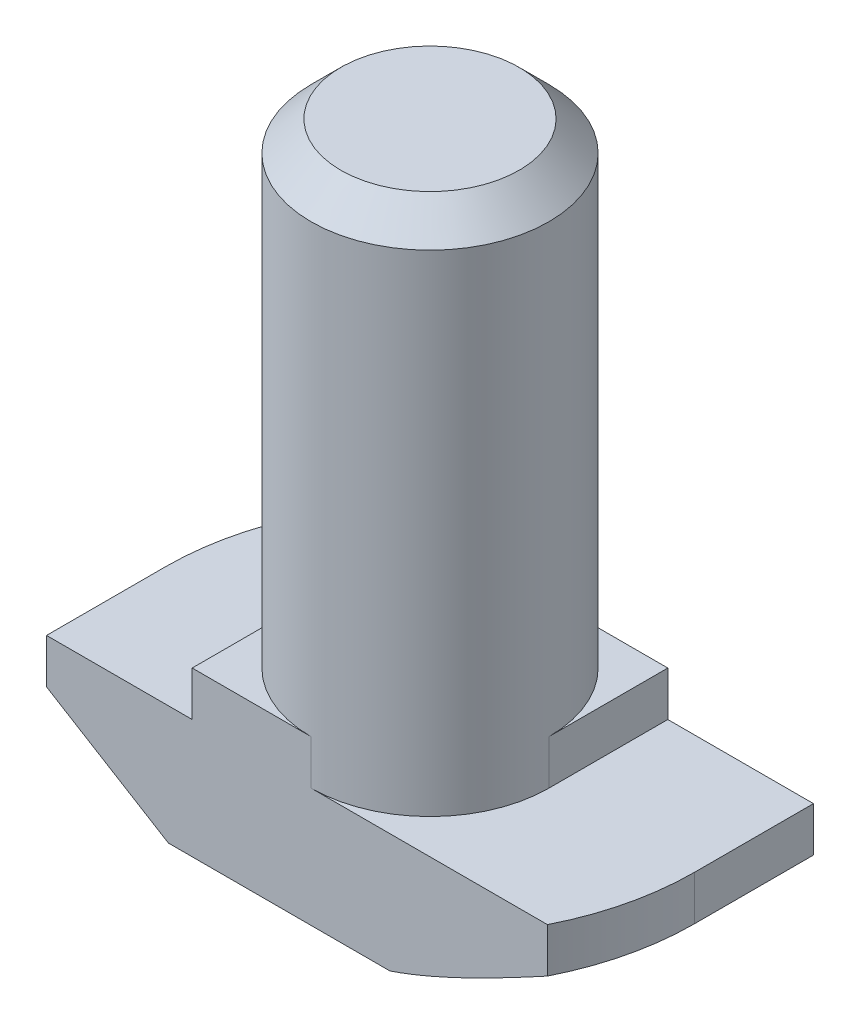
ISO-10303-21;
HEADER;
FILE_DESCRIPTION(('STEP AP214'),'2;1');
FILE_NAME('part.step','',(''),(''),'','','');
FILE_SCHEMA(('AUTOMOTIVE_DESIGN { 1 0 10303 214 1 1 1 1 }'));
ENDSEC;
DATA;
#1=APPLICATION_CONTEXT('core data for automotive mechanical design processes');
#2=APPLICATION_PROTOCOL_DEFINITION('international standard','automotive_design',2000,#1);
#3=PRODUCT_CONTEXT('',#1,'mechanical');
#4=PRODUCT('Part','Part','',(#3));
#5=PRODUCT_RELATED_PRODUCT_CATEGORY('part','',(#4));
#6=PRODUCT_DEFINITION_FORMATION('','',#4);
#7=PRODUCT_DEFINITION_CONTEXT('part definition',#1,'design');
#8=PRODUCT_DEFINITION('design','',#6,#7);
#9=PRODUCT_DEFINITION_SHAPE('','',#8);
#10=(LENGTH_UNIT() NAMED_UNIT(*) SI_UNIT(.MILLI.,.METRE.));
#11=(NAMED_UNIT(*) PLANE_ANGLE_UNIT() SI_UNIT($,.RADIAN.));
#12=(NAMED_UNIT(*) SI_UNIT($,.STERADIAN.) SOLID_ANGLE_UNIT());
#13=UNCERTAINTY_MEASURE_WITH_UNIT(LENGTH_MEASURE(1.E-05),#10,'distance_accuracy_value','');
#14=(GEOMETRIC_REPRESENTATION_CONTEXT(3) GLOBAL_UNCERTAINTY_ASSIGNED_CONTEXT((#13)) GLOBAL_UNIT_ASSIGNED_CONTEXT((#10,
#11,#12)) REPRESENTATION_CONTEXT('',''));
#15=CARTESIAN_POINT('',(0.,0.,0.));
#16=DIRECTION('',(0.,0.,1.));
#17=DIRECTION('',(1.,0.,0.));
#18=AXIS2_PLACEMENT_3D('',#15,#16,#17);
#19=CARTESIAN_POINT('',(-8.9,0.,4.));
#20=DIRECTION('',(1.,0.,0.));
#21=DIRECTION('',(0.,0.,-1.));
#22=AXIS2_PLACEMENT_3D('',#19,#20,#21);
#23=PLANE('',#22);
#24=DIRECTION('',(0.,0.,-1.));
#25=VECTOR('',#24,1.);
#26=CARTESIAN_POINT('',(-8.9,2.5,4.));
#27=LINE('',#26,#25);
#28=CARTESIAN_POINT('',(-8.9,2.5,4.));
#29=VERTEX_POINT('',#28);
#30=CARTESIAN_POINT('',(-8.9,2.5,0.));
#31=VERTEX_POINT('',#30);
#32=EDGE_CURVE('E368',#29,#31,#27,.T.);
#33=ORIENTED_EDGE('',*,*,#32,.F.);
#34=DIRECTION('',(0.,-1.,0.));
#35=VECTOR('',#34,1.);
#36=CARTESIAN_POINT('',(-8.9,0.,4.));
#37=LINE('',#36,#35);
#38=CARTESIAN_POINT('',(-8.9,4.,4.));
#39=VERTEX_POINT('',#38);
#40=EDGE_CURVE('E208',#39,#29,#37,.T.);
#41=ORIENTED_EDGE('',*,*,#40,.F.);
#42=DIRECTION('',(0.,0.,-1.));
#43=VECTOR('',#42,1.);
#44=CARTESIAN_POINT('',(-8.9,4.,4.));
#45=LINE('',#44,#43);
#46=CARTESIAN_POINT('',(-8.9,4.,0.));
#47=VERTEX_POINT('',#46);
#48=EDGE_CURVE('E223',#39,#47,#45,.T.);
#49=ORIENTED_EDGE('',*,*,#48,.T.);
#50=DIRECTION('',(0.,1.,0.));
#51=VECTOR('',#50,1.);
#52=CARTESIAN_POINT('',(-8.9,0.,0.));
#53=LINE('',#52,#51);
#54=EDGE_CURVE('E196',#31,#47,#53,.T.);
#55=ORIENTED_EDGE('',*,*,#54,.F.);
#56=EDGE_LOOP('',(#33,#41,#49,#55));
#57=FACE_BOUND('',#56,.T.);
#58=ADVANCED_FACE('F38',(#57),#23,.F.);
#59=CARTESIAN_POINT('',(8.9,0.,4.));
#60=DIRECTION('',(0.,1.,0.));
#61=DIRECTION('',(0.,0.,1.));
#62=AXIS2_PLACEMENT_3D('',#59,#60,#61);
#63=PLANE('',#62);
#64=DIRECTION('',(1.,0.,0.));
#65=VECTOR('',#64,1.);
#66=CARTESIAN_POINT('',(8.9,0.,4.));
#67=LINE('',#66,#65);
#68=CARTESIAN_POINT('',(-4.8,0.,4.));
#69=VERTEX_POINT('',#68);
#70=CARTESIAN_POINT('',(2.65329983228432,0.,4.));
#71=VERTEX_POINT('',#70);
#72=EDGE_CURVE('E211',#69,#71,#67,.T.);
#73=ORIENTED_EDGE('',*,*,#72,.F.);
#74=DIRECTION('',(0.,0.,-1.));
#75=VECTOR('',#74,1.);
#76=CARTESIAN_POINT('',(-4.8,0.,4.));
#77=LINE('',#76,#75);
#78=CARTESIAN_POINT('',(-4.8,0.,0.));
#79=VERTEX_POINT('',#78);
#80=EDGE_CURVE('E366',#69,#79,#77,.T.);
#81=ORIENTED_EDGE('',*,*,#80,.T.);
#82=CARTESIAN_POINT('',(0.,0.,0.));
#83=DIRECTION('',(0.,-1.,0.));
#84=DIRECTION('',(-1.,0.,0.));
#85=AXIS2_PLACEMENT_3D('',#82,#83,#84);
#86=CIRCLE('',#85,4.8);
#87=CARTESIAN_POINT('',(-2.65329983228432,0.,-4.));
#88=VERTEX_POINT('',#87);
#89=EDGE_CURVE('E365',#79,#88,#86,.T.);
#90=ORIENTED_EDGE('',*,*,#89,.T.);
#91=DIRECTION('',(1.,0.,0.));
#92=VECTOR('',#91,1.);
#93=CARTESIAN_POINT('',(8.9,0.,-4.));
#94=LINE('',#93,#92);
#95=CARTESIAN_POINT('',(4.8,0.,-4.));
#96=VERTEX_POINT('',#95);
#97=EDGE_CURVE('E207',#88,#96,#94,.T.);
#98=ORIENTED_EDGE('',*,*,#97,.T.);
#99=DIRECTION('',(0.,0.,1.));
#100=VECTOR('',#99,1.);
#101=CARTESIAN_POINT('',(4.8,0.,-8.9));
#102=LINE('',#101,#100);
#103=CARTESIAN_POINT('',(4.8,0.,0.));
#104=VERTEX_POINT('',#103);
#105=EDGE_CURVE('E54',#96,#104,#102,.T.);
#106=ORIENTED_EDGE('',*,*,#105,.T.);
#107=CARTESIAN_POINT('',(0.,0.,0.));
#108=DIRECTION('',(0.,-1.,0.));
#109=DIRECTION('',(1.,0.,0.));
#110=AXIS2_PLACEMENT_3D('',#107,#108,#109);
#111=CIRCLE('',#110,4.8);
#112=EDGE_CURVE('E154',#104,#71,#111,.T.);
#113=ORIENTED_EDGE('',*,*,#112,.T.);
#114=EDGE_LOOP('',(#73,#81,#90,#98,#106,#113));
#115=FACE_BOUND('',#114,.T.);
#116=ADVANCED_FACE('F269',(#115),#63,.F.);
#117=CARTESIAN_POINT('',(8.9,0.,4.));
#118=DIRECTION('',(-1.,0.,0.));
#119=DIRECTION('',(0.,0.,1.));
#120=AXIS2_PLACEMENT_3D('',#117,#118,#119);
#121=PLANE('',#120);
#122=DIRECTION('',(0.,0.,1.));
#123=VECTOR('',#122,1.);
#124=CARTESIAN_POINT('',(8.9,2.5,-8.9));
#125=LINE('',#124,#123);
#126=CARTESIAN_POINT('',(8.9,2.5,-4.));
#127=VERTEX_POINT('',#126);
#128=CARTESIAN_POINT('',(8.9,2.5,0.));
#129=VERTEX_POINT('',#128);
#130=EDGE_CURVE('E146',#127,#129,#125,.T.);
#131=ORIENTED_EDGE('',*,*,#130,.F.);
#132=DIRECTION('',(0.,1.,0.));
#133=VECTOR('',#132,1.);
#134=CARTESIAN_POINT('',(8.9,0.,-4.));
#135=LINE('',#134,#133);
#136=CARTESIAN_POINT('',(8.9,4.,-4.));
#137=VERTEX_POINT('',#136);
#138=EDGE_CURVE('E226',#127,#137,#135,.T.);
#139=ORIENTED_EDGE('',*,*,#138,.T.);
#140=DIRECTION('',(0.,0.,-1.));
#141=VECTOR('',#140,1.);
#142=CARTESIAN_POINT('',(8.9,4.,4.));
#143=LINE('',#142,#141);
#144=CARTESIAN_POINT('',(8.9,4.,0.));
#145=VERTEX_POINT('',#144);
#146=EDGE_CURVE('E174',#145,#137,#143,.T.);
#147=ORIENTED_EDGE('',*,*,#146,.F.);
#148=DIRECTION('',(0.,1.,0.));
#149=VECTOR('',#148,1.);
#150=CARTESIAN_POINT('',(8.9,0.,0.));
#151=LINE('',#150,#149);
#152=EDGE_CURVE('E167',#129,#145,#151,.T.);
#153=ORIENTED_EDGE('',*,*,#152,.F.);
#154=EDGE_LOOP('',(#131,#139,#147,#153));
#155=FACE_BOUND('',#154,.T.);
#156=ADVANCED_FACE('F172',(#155),#121,.F.);
#157=CARTESIAN_POINT('',(0.,0.,4.));
#158=DIRECTION('',(0.,0.,-1.));
#159=DIRECTION('',(-1.,0.,0.));
#160=AXIS2_PLACEMENT_3D('',#157,#158,#159);
#161=PLANE('',#160);
#162=DIRECTION('',(-0.853796175794036,0.520607424264656,0.));
#163=VECTOR('',#162,1.);
#164=CARTESIAN_POINT('',(-8.9,2.5,4.));
#165=LINE('',#164,#163);
#166=EDGE_CURVE('E374',#69,#29,#165,.T.);
#167=ORIENTED_EDGE('',*,*,#166,.F.);
#168=ORIENTED_EDGE('',*,*,#72,.T.);
#169=CARTESIAN_POINT('',(7.95117168412038,2.5003812948523,4.));
#170=CARTESIAN_POINT('',(7.73552594180779,2.38294262104349,4.));
#171=CARTESIAN_POINT('',(7.51949196287052,2.26620761305275,4.));
#172=CARTESIAN_POINT('',(7.08640702943254,2.03458295404349,4.));
#173=CARTESIAN_POINT('',(6.86935596494317,1.91969350884632,4.));
#174=CARTESIAN_POINT('',(6.43326841812792,1.6918189237928,4.));
#175=CARTESIAN_POINT('',(6.21422761700308,1.57884202880893,4.));
#176=CARTESIAN_POINT('',(5.77463734455681,1.3558784061402,4.));
#177=CARTESIAN_POINT('',(5.55408794028136,1.24589154663778,4.));
#178=CARTESIAN_POINT('',(5.11647910281973,1.03243373636638,4.));
#179=CARTESIAN_POINT('',(4.89946541196746,0.92886934419743,4.));
#180=CARTESIAN_POINT('',(4.46314517755054,0.726599943828819,4.));
#181=CARTESIAN_POINT('',(4.24383839666258,0.627895444761259,4.));
#182=CARTESIAN_POINT('',(3.80261128872497,0.437105119516572,4.));
#183=CARTESIAN_POINT('',(3.5806938708347,0.345012613183118,4.));
#184=CARTESIAN_POINT('',(3.13341004119999,0.169681531704238,4.));
#185=CARTESIAN_POINT('',(2.90804453781551,0.0864406691133928,4.));
#186=CARTESIAN_POINT('',(2.46564049107812,-0.0637337384147157,4.));
#187=CARTESIAN_POINT('',(2.24882314531661,-0.131311270143758,4.));
#188=CARTESIAN_POINT('',(1.81134539093152,-0.252017085141675,4.));
#189=CARTESIAN_POINT('',(1.59068966949939,-0.305161832872051,4.));
#190=CARTESIAN_POINT('',(1.25578974895032,-0.37125386899099,4.));
#191=CARTESIAN_POINT('',(1.1428915032614,-0.391082257285261,4.));
#192=CARTESIAN_POINT('',(0.916303642162891,-0.425522742673794,4.));
#193=CARTESIAN_POINT('',(0.802614110911478,-0.440135386106777,4.));
#194=CARTESIAN_POINT('',(0.574171741878051,-0.463762938801405,4.));
#195=CARTESIAN_POINT('',(0.459416448807066,-0.472754337723224,4.));
#196=CARTESIAN_POINT('',(0.229544837125645,-0.484799371089924,4.));
#197=CARTESIAN_POINT('',(0.11442837922421,-0.487850330163754,4.));
#198=CARTESIAN_POINT('',(-0.000700000000000364,-0.487804840701222,4.));
#199=B_SPLINE_CURVE_WITH_KNOTS('',3,(#169,#170,#171,#172,#173,#174,#175,#176,#177,#178,#179,
#180,#181,#182,#183,#184,#185,#186,#187,#188,#189,#190,#191,#192,#193,#194,#195,#196,#197,#198),
.UNSPECIFIED.,.F.,.F.,(4,2,2,2,2,2,2,2,2,2,2,2,2,2,4),(0.,0.73665607857229,1.47339374819651,
2.212756769811,2.95208714311461,3.6734194697194,4.39482720444832,5.11549552795205,
5.83597716113291,6.51694414905028,7.19713101684283,7.54090798827143,7.88464893918285,
8.22981810256985,8.57514268242548),.UNSPECIFIED.);
#200=CARTESIAN_POINT('',(7.95047168412038,2.5,4.));
#201=VERTEX_POINT('',#200);
#202=EDGE_CURVE('E318',#201,#71,#199,.T.);
#203=ORIENTED_EDGE('',*,*,#202,.F.);
#204=DIRECTION('',(0.,1.,0.));
#205=VECTOR('',#204,1.);
#206=CARTESIAN_POINT('',(7.95047168412038,0.,4.));
#207=LINE('',#206,#205);
#208=CARTESIAN_POINT('',(7.95047168412038,4.,4.));
#209=VERTEX_POINT('',#208);
#210=EDGE_CURVE('E169',#201,#209,#207,.T.);
#211=ORIENTED_EDGE('',*,*,#210,.T.);
#212=DIRECTION('',(-1.,0.,0.));
#213=VECTOR('',#212,1.);
#214=CARTESIAN_POINT('',(8.9,4.,4.));
#215=LINE('',#214,#213);
#216=CARTESIAN_POINT('',(0.,4.,4.));
#217=VERTEX_POINT('',#216);
#218=EDGE_CURVE('E215',#209,#217,#215,.T.);
#219=ORIENTED_EDGE('',*,*,#218,.T.);
#220=DIRECTION('',(0.,1.,0.));
#221=VECTOR('',#220,1.);
#222=CARTESIAN_POINT('',(0.,-1.65685424949238,4.));
#223=LINE('',#222,#221);
#224=CARTESIAN_POINT('',(0.,5.5,4.));
#225=VERTEX_POINT('',#224);
#226=EDGE_CURVE('E192',#217,#225,#223,.T.);
#227=ORIENTED_EDGE('',*,*,#226,.T.);
#228=DIRECTION('',(-1.,0.,0.));
#229=VECTOR('',#228,1.);
#230=CARTESIAN_POINT('',(-4.,5.5,4.));
#231=LINE('',#230,#229);
#232=CARTESIAN_POINT('',(-4.,5.5,4.));
#233=VERTEX_POINT('',#232);
#234=EDGE_CURVE('E217',#225,#233,#231,.T.);
#235=ORIENTED_EDGE('',*,*,#234,.T.);
#236=DIRECTION('',(0.,-1.,0.));
#237=VECTOR('',#236,1.);
#238=CARTESIAN_POINT('',(-4.,4.,4.));
#239=LINE('',#238,#237);
#240=CARTESIAN_POINT('',(-4.,4.,4.));
#241=VERTEX_POINT('',#240);
#242=EDGE_CURVE('E219',#233,#241,#239,.T.);
#243=ORIENTED_EDGE('',*,*,#242,.T.);
#244=DIRECTION('',(-1.,0.,0.));
#245=VECTOR('',#244,1.);
#246=CARTESIAN_POINT('',(-8.9,4.,4.));
#247=LINE('',#246,#245);
#248=EDGE_CURVE('E221',#241,#39,#247,.T.);
#249=ORIENTED_EDGE('',*,*,#248,.T.);
#250=ORIENTED_EDGE('',*,*,#40,.T.);
#251=EDGE_LOOP('',(#167,#168,#203,#211,#219,#227,#235,#243,#249,#250));
#252=FACE_BOUND('',#251,.T.);
#253=ADVANCED_FACE('F280',(#252),#161,.F.);
#254=CARTESIAN_POINT('',(0.,0.,-4.));
#255=DIRECTION('',(0.,0.,-1.));
#256=DIRECTION('',(-1.,0.,0.));
#257=AXIS2_PLACEMENT_3D('',#254,#255,#256);
#258=PLANE('',#257);
#259=ORIENTED_EDGE('',*,*,#97,.F.);
#260=CARTESIAN_POINT('',(0.000700000000000375,-0.487804840701222,-4.));
#261=CARTESIAN_POINT('',(-0.0911783891396318,-0.48782848460975,-4.));
#262=CARTESIAN_POINT('',(-0.183052746172593,-0.485894534221646,-4.));
#263=CARTESIAN_POINT('',(-0.366624394777082,-0.478214110158694,-4.));
#264=CARTESIAN_POINT('',(-0.458321717815279,-0.472468391698149,-4.));
#265=CARTESIAN_POINT('',(-0.641197389589646,-0.457284413495929,-4.));
#266=CARTESIAN_POINT('',(-0.732376445680467,-0.447854631312074,-4.));
#267=CARTESIAN_POINT('',(-0.914302231773763,-0.425490539884402,-4.));
#268=CARTESIAN_POINT('',(-1.00504894282095,-0.41255607839799,-4.));
#269=CARTESIAN_POINT('',(-1.27475669839242,-0.369111241216707,-4.));
#270=CARTESIAN_POINT('',(-1.45295798960378,-0.333803642672856,-4.));
#271=CARTESIAN_POINT('',(-1.80688694554488,-0.252374259841994,-4.));
#272=CARTESIAN_POINT('',(-1.98261350049563,-0.206247777936689,-4.));
#273=CARTESIAN_POINT('',(-2.40843477616905,-0.0830176290147687,-4.));
#274=CARTESIAN_POINT('',(-2.65716286909735,-0.00122224492027907,-4.));
#275=CARTESIAN_POINT('',(-3.1500236667871,0.175317023068226,-4.));
#276=CARTESIAN_POINT('',(-3.39415374276215,0.270068072754652,-4.));
#277=CARTESIAN_POINT('',(-3.87928874246701,0.469058436828284,-4.));
#278=CARTESIAN_POINT('',(-4.12028285320838,0.573323871149427,-4.));
#279=CARTESIAN_POINT('',(-4.59919632282166,0.788504405818799,-4.));
#280=CARTESIAN_POINT('',(-4.83711633279242,0.899418069039211,-4.));
#281=CARTESIAN_POINT('',(-5.31822851183188,1.1297988974704,-4.));
#282=CARTESIAN_POINT('',(-5.56134348218909,1.24942652452964,-4.));
#283=CARTESIAN_POINT('',(-6.045636996258,1.49257282867588,-4.));
#284=CARTESIAN_POINT('',(-6.28681538137222,1.61609182045058,-4.));
#285=CARTESIAN_POINT('',(-6.76588702271679,1.86515627626158,-4.));
#286=CARTESIAN_POINT('',(-7.0037914098582,1.99068039524177,-4.));
#287=CARTESIAN_POINT('',(-7.47834127800901,2.24398618358021,-4.));
#288=CARTESIAN_POINT('',(-7.71498697875761,2.37176744085524,-4.));
#289=CARTESIAN_POINT('',(-7.95117168412038,2.50038129485229,-4.));
#290=B_SPLINE_CURVE_WITH_KNOTS('',3,(#260,#261,#262,#263,#264,#265,#266,#267,#268,#269,#270,
#271,#272,#273,#274,#275,#276,#277,#278,#279,#280,#281,#282,#283,#284,#285,#286,#287,#288,#289),
.UNSPECIFIED.,.F.,.F.,(4,2,2,2,2,2,2,2,2,2,2,2,2,2,4),(0.,0.275607667670162,0.551160746311937,
0.82608343769266,1.10101807357745,1.64556230190507,2.19034341346489,2.97528858833922,
3.76066968678114,4.54827578228531,5.33571223306797,6.14852584679743,6.96140536089395,
7.76835733370051,8.57516347444109),.UNSPECIFIED.);
#291=CARTESIAN_POINT('',(-7.95047168412038,2.5,-4.));
#292=VERTEX_POINT('',#291);
#293=EDGE_CURVE('E312',#88,#292,#290,.T.);
#294=ORIENTED_EDGE('',*,*,#293,.T.);
#295=DIRECTION('',(0.,1.,0.));
#296=VECTOR('',#295,1.);
#297=CARTESIAN_POINT('',(-7.95047168412038,0.,-4.));
#298=LINE('',#297,#296);
#299=CARTESIAN_POINT('',(-7.95047168412038,4.,-4.));
#300=VERTEX_POINT('',#299);
#301=EDGE_CURVE('E178',#292,#300,#298,.T.);
#302=ORIENTED_EDGE('',*,*,#301,.T.);
#303=DIRECTION('',(-1.,0.,0.));
#304=VECTOR('',#303,1.);
#305=CARTESIAN_POINT('',(-8.9,4.,-4.));
#306=LINE('',#305,#304);
#307=CARTESIAN_POINT('',(0.,4.,-4.));
#308=VERTEX_POINT('',#307);
#309=EDGE_CURVE('E212',#308,#300,#306,.T.);
#310=ORIENTED_EDGE('',*,*,#309,.F.);
#311=DIRECTION('',(0.,1.,0.));
#312=VECTOR('',#311,1.);
#313=CARTESIAN_POINT('',(0.,-1.65685424949238,-4.));
#314=LINE('',#313,#312);
#315=CARTESIAN_POINT('',(0.,5.5,-4.));
#316=VERTEX_POINT('',#315);
#317=EDGE_CURVE('E203',#308,#316,#314,.T.);
#318=ORIENTED_EDGE('',*,*,#317,.T.);
#319=DIRECTION('',(-1.,0.,0.));
#320=VECTOR('',#319,1.);
#321=CARTESIAN_POINT('',(-4.,5.5,-4.));
#322=LINE('',#321,#320);
#323=CARTESIAN_POINT('',(4.,5.5,-4.));
#324=VERTEX_POINT('',#323);
#325=EDGE_CURVE('E234',#324,#316,#322,.T.);
#326=ORIENTED_EDGE('',*,*,#325,.F.);
#327=DIRECTION('',(0.,1.,0.));
#328=VECTOR('',#327,1.);
#329=CARTESIAN_POINT('',(4.,4.,-4.));
#330=LINE('',#329,#328);
#331=CARTESIAN_POINT('',(4.,4.,-4.));
#332=VERTEX_POINT('',#331);
#333=EDGE_CURVE('E231',#332,#324,#330,.T.);
#334=ORIENTED_EDGE('',*,*,#333,.F.);
#335=DIRECTION('',(-1.,0.,0.));
#336=VECTOR('',#335,1.);
#337=CARTESIAN_POINT('',(8.9,4.,-4.));
#338=LINE('',#337,#336);
#339=EDGE_CURVE('E228',#137,#332,#338,.T.);
#340=ORIENTED_EDGE('',*,*,#339,.F.);
#341=ORIENTED_EDGE('',*,*,#138,.F.);
#342=DIRECTION('',(-0.853796175794036,-0.520607424264656,0.));
#343=VECTOR('',#342,1.);
#344=CARTESIAN_POINT('',(1.3009540329575,-2.13356461405031,-4.));
#345=LINE('',#344,#343);
#346=EDGE_CURVE('E150',#127,#96,#345,.T.);
#347=ORIENTED_EDGE('',*,*,#346,.T.);
#348=EDGE_LOOP('',(#259,#294,#302,#310,#318,#326,#334,#340,#341,#347));
#349=FACE_BOUND('',#348,.T.);
#350=ADVANCED_FACE('F303',(#349),#258,.T.);
#351=CARTESIAN_POINT('',(0.,0.,0.));
#352=DIRECTION('',(0.,1.,0.));
#353=DIRECTION('',(0.,0.,1.));
#354=AXIS2_PLACEMENT_3D('',#351,#352,#353);
#355=CYLINDRICAL_SURFACE('',#354,8.9);
#356=CARTESIAN_POINT('',(0.,2.5,0.));
#357=DIRECTION('',(0.,-1.,0.));
#358=DIRECTION('',(-1.,0.,0.));
#359=AXIS2_PLACEMENT_3D('',#356,#357,#358);
#360=CIRCLE('',#359,8.9);
#361=EDGE_CURVE('E62',#31,#292,#360,.T.);
#362=ORIENTED_EDGE('',*,*,#361,.F.);
#363=ORIENTED_EDGE('',*,*,#54,.T.);
#364=CARTESIAN_POINT('',(0.,4.,0.));
#365=DIRECTION('',(0.,-1.,0.));
#366=DIRECTION('',(0.,0.,-1.));
#367=AXIS2_PLACEMENT_3D('',#364,#365,#366);
#368=CIRCLE('',#367,8.9);
#369=EDGE_CURVE('E175',#47,#300,#368,.T.);
#370=ORIENTED_EDGE('',*,*,#369,.T.);
#371=ORIENTED_EDGE('',*,*,#301,.F.);
#372=EDGE_LOOP('',(#362,#363,#370,#371));
#373=FACE_BOUND('',#372,.T.);
#374=ADVANCED_FACE('F307',(#373),#355,.T.);
#375=CARTESIAN_POINT('',(0.,0.,0.));
#376=DIRECTION('',(0.,1.,0.));
#377=DIRECTION('',(0.,0.,1.));
#378=AXIS2_PLACEMENT_3D('',#375,#376,#377);
#379=CYLINDRICAL_SURFACE('',#378,8.9);
#380=CARTESIAN_POINT('',(0.,2.5,0.));
#381=DIRECTION('',(0.,-1.,0.));
#382=DIRECTION('',(1.,0.,0.));
#383=AXIS2_PLACEMENT_3D('',#380,#381,#382);
#384=CIRCLE('',#383,8.9);
#385=EDGE_CURVE('E159',#129,#201,#384,.T.);
#386=ORIENTED_EDGE('',*,*,#385,.F.);
#387=ORIENTED_EDGE('',*,*,#152,.T.);
#388=CARTESIAN_POINT('',(0.,4.,0.));
#389=DIRECTION('',(0.,-1.,0.));
#390=DIRECTION('',(0.,0.,-1.));
#391=AXIS2_PLACEMENT_3D('',#388,#389,#390);
#392=CIRCLE('',#391,8.9);
#393=EDGE_CURVE('E180',#145,#209,#392,.T.);
#394=ORIENTED_EDGE('',*,*,#393,.T.);
#395=ORIENTED_EDGE('',*,*,#210,.F.);
#396=EDGE_LOOP('',(#386,#387,#394,#395));
#397=FACE_BOUND('',#396,.T.);
#398=ADVANCED_FACE('F165',(#397),#379,.T.);
#399=CARTESIAN_POINT('',(-4.,5.5,4.));
#400=DIRECTION('',(0.,-1.,0.));
#401=DIRECTION('',(0.,0.,-1.));
#402=AXIS2_PLACEMENT_3D('',#399,#400,#401);
#403=PLANE('',#402);
#404=CARTESIAN_POINT('',(0.,5.5,0.));
#405=DIRECTION('',(0.,1.,0.));
#406=DIRECTION('',(0.,0.,1.));
#407=AXIS2_PLACEMENT_3D('',#404,#405,#406);
#408=CIRCLE('',#407,4.);
#409=CARTESIAN_POINT('',(4.,5.5,0.));
#410=VERTEX_POINT('',#409);
#411=EDGE_CURVE('E185',#410,#316,#408,.T.);
#412=ORIENTED_EDGE('',*,*,#411,.F.);
#413=DIRECTION('',(0.,0.,-1.));
#414=VECTOR('',#413,1.);
#415=CARTESIAN_POINT('',(4.,5.5,4.));
#416=LINE('',#415,#414);
#417=EDGE_CURVE('E247',#410,#324,#416,.T.);
#418=ORIENTED_EDGE('',*,*,#417,.T.);
#419=ORIENTED_EDGE('',*,*,#325,.T.);
#420=EDGE_LOOP('',(#412,#418,#419));
#421=FACE_BOUND('',#420,.T.);
#422=ADVANCED_FACE('F293',(#421),#403,.F.);
#423=CARTESIAN_POINT('',(-4.,5.5,0.));
#424=VERTEX_POINT('',#423);
#425=EDGE_CURVE('E188',#424,#225,#408,.T.);
#426=ORIENTED_EDGE('',*,*,#425,.F.);
#427=DIRECTION('',(0.,0.,-1.));
#428=VECTOR('',#427,1.);
#429=CARTESIAN_POINT('',(-4.,5.5,4.));
#430=LINE('',#429,#428);
#431=EDGE_CURVE('E244',#233,#424,#430,.T.);
#432=ORIENTED_EDGE('',*,*,#431,.F.);
#433=ORIENTED_EDGE('',*,*,#234,.F.);
#434=EDGE_LOOP('',(#426,#432,#433));
#435=FACE_BOUND('',#434,.T.);
#436=ADVANCED_FACE('F285',(#435),#403,.F.);
#437=CARTESIAN_POINT('',(8.9,4.,4.));
#438=DIRECTION('',(0.,-1.,0.));
#439=DIRECTION('',(0.,0.,-1.));
#440=AXIS2_PLACEMENT_3D('',#437,#438,#439);
#441=PLANE('',#440);
#442=ORIENTED_EDGE('',*,*,#218,.F.);
#443=ORIENTED_EDGE('',*,*,#393,.F.);
#444=ORIENTED_EDGE('',*,*,#146,.T.);
#445=ORIENTED_EDGE('',*,*,#339,.T.);
#446=DIRECTION('',(0.,0.,-1.));
#447=VECTOR('',#446,1.);
#448=CARTESIAN_POINT('',(4.,4.,4.));
#449=LINE('',#448,#447);
#450=CARTESIAN_POINT('',(4.,4.,0.));
#451=VERTEX_POINT('',#450);
#452=EDGE_CURVE('E249',#451,#332,#449,.T.);
#453=ORIENTED_EDGE('',*,*,#452,.F.);
#454=CARTESIAN_POINT('',(0.,4.,0.));
#455=DIRECTION('',(0.,-1.,0.));
#456=DIRECTION('',(0.,0.,-1.));
#457=AXIS2_PLACEMENT_3D('',#454,#455,#456);
#458=CIRCLE('',#457,4.);
#459=EDGE_CURVE('E189',#451,#217,#458,.T.);
#460=ORIENTED_EDGE('',*,*,#459,.T.);
#461=EDGE_LOOP('',(#442,#443,#444,#445,#453,#460));
#462=FACE_BOUND('',#461,.T.);
#463=ADVANCED_FACE('F281',(#462),#441,.F.);
#464=CARTESIAN_POINT('',(4.,4.,4.));
#465=DIRECTION('',(-1.,0.,0.));
#466=DIRECTION('',(0.,0.,1.));
#467=AXIS2_PLACEMENT_3D('',#464,#465,#466);
#468=PLANE('',#467);
#469=ORIENTED_EDGE('',*,*,#417,.F.);
#470=DIRECTION('',(0.,1.,0.));
#471=VECTOR('',#470,1.);
#472=CARTESIAN_POINT('',(4.,-1.65685424949238,0.));
#473=LINE('',#472,#471);
#474=EDGE_CURVE('E193',#451,#410,#473,.T.);
#475=ORIENTED_EDGE('',*,*,#474,.F.);
#476=ORIENTED_EDGE('',*,*,#452,.T.);
#477=ORIENTED_EDGE('',*,*,#333,.T.);
#478=EDGE_LOOP('',(#469,#475,#476,#477));
#479=FACE_BOUND('',#478,.T.);
#480=ADVANCED_FACE('F284',(#479),#468,.F.);
#481=CARTESIAN_POINT('',(-4.,4.,4.));
#482=DIRECTION('',(1.,0.,0.));
#483=DIRECTION('',(0.,0.,-1.));
#484=AXIS2_PLACEMENT_3D('',#481,#482,#483);
#485=PLANE('',#484);
#486=ORIENTED_EDGE('',*,*,#431,.T.);
#487=DIRECTION('',(0.,1.,0.));
#488=VECTOR('',#487,1.);
#489=CARTESIAN_POINT('',(-4.,-1.65685424949238,0.));
#490=LINE('',#489,#488);
#491=CARTESIAN_POINT('',(-4.,4.,0.));
#492=VERTEX_POINT('',#491);
#493=EDGE_CURVE('E199',#492,#424,#490,.T.);
#494=ORIENTED_EDGE('',*,*,#493,.F.);
#495=DIRECTION('',(0.,0.,-1.));
#496=VECTOR('',#495,1.);
#497=CARTESIAN_POINT('',(-4.,4.,4.));
#498=LINE('',#497,#496);
#499=EDGE_CURVE('E241',#241,#492,#498,.T.);
#500=ORIENTED_EDGE('',*,*,#499,.F.);
#501=ORIENTED_EDGE('',*,*,#242,.F.);
#502=EDGE_LOOP('',(#486,#494,#500,#501));
#503=FACE_BOUND('',#502,.T.);
#504=ADVANCED_FACE('F289',(#503),#485,.F.);
#505=CARTESIAN_POINT('',(-8.9,4.,4.));
#506=DIRECTION('',(0.,-1.,0.));
#507=DIRECTION('',(0.,0.,-1.));
#508=AXIS2_PLACEMENT_3D('',#505,#506,#507);
#509=PLANE('',#508);
#510=ORIENTED_EDGE('',*,*,#309,.T.);
#511=ORIENTED_EDGE('',*,*,#369,.F.);
#512=ORIENTED_EDGE('',*,*,#48,.F.);
#513=ORIENTED_EDGE('',*,*,#248,.F.);
#514=ORIENTED_EDGE('',*,*,#499,.T.);
#515=CARTESIAN_POINT('',(0.,4.,0.));
#516=DIRECTION('',(0.,-1.,0.));
#517=DIRECTION('',(0.,0.,-1.));
#518=AXIS2_PLACEMENT_3D('',#515,#516,#517);
#519=CIRCLE('',#518,4.);
#520=EDGE_CURVE('E200',#492,#308,#519,.T.);
#521=ORIENTED_EDGE('',*,*,#520,.T.);
#522=EDGE_LOOP('',(#510,#511,#512,#513,#514,#521));
#523=FACE_BOUND('',#522,.T.);
#524=ADVANCED_FACE('F297',(#523),#509,.F.);
#525=CARTESIAN_POINT('',(0.,-1.65685424949238,0.));
#526=DIRECTION('',(0.,1.,0.));
#527=DIRECTION('',(0.,0.,1.));
#528=AXIS2_PLACEMENT_3D('',#525,#526,#527);
#529=CYLINDRICAL_SURFACE('',#528,4.);
#530=CARTESIAN_POINT('',(0.,20.5,0.));
#531=DIRECTION('',(0.,1.,0.));
#532=DIRECTION('',(0.,0.,1.));
#533=AXIS2_PLACEMENT_3D('',#530,#531,#532);
#534=CIRCLE('',#533,4.);
#535=CARTESIAN_POINT('',(0.,20.5,4.));
#536=VERTEX_POINT('',#535);
#537=EDGE_CURVE('E11',#536,#536,#534,.F.);
#538=ORIENTED_EDGE('',*,*,#537,.T.);
#539=EDGE_LOOP('',(#538));
#540=FACE_BOUND('',#539,.T.);
#541=ORIENTED_EDGE('',*,*,#474,.T.);
#542=ORIENTED_EDGE('',*,*,#411,.T.);
#543=ORIENTED_EDGE('',*,*,#317,.F.);
#544=ORIENTED_EDGE('',*,*,#520,.F.);
#545=ORIENTED_EDGE('',*,*,#493,.T.);
#546=ORIENTED_EDGE('',*,*,#425,.T.);
#547=ORIENTED_EDGE('',*,*,#226,.F.);
#548=ORIENTED_EDGE('',*,*,#459,.F.);
#549=EDGE_LOOP('',(#541,#542,#543,#544,#545,#546,#547,#548));
#550=FACE_BOUND('',#549,.T.);
#551=ADVANCED_FACE('F301',(#540,#550),#529,.T.);
#552=CARTESIAN_POINT('',(0.,21.5,0.));
#553=DIRECTION('',(0.,1.,0.));
#554=DIRECTION('',(0.,0.,1.));
#555=AXIS2_PLACEMENT_3D('',#552,#553,#554);
#556=PLANE('',#555);
#557=CARTESIAN_POINT('',(0.,21.5,0.));
#558=DIRECTION('',(0.,1.,0.));
#559=DIRECTION('',(0.,0.,1.));
#560=AXIS2_PLACEMENT_3D('',#557,#558,#559);
#561=CIRCLE('',#560,3.);
#562=CARTESIAN_POINT('',(0.,21.5,3.));
#563=VERTEX_POINT('',#562);
#564=EDGE_CURVE('E47',#563,#563,#561,.T.);
#565=ORIENTED_EDGE('',*,*,#564,.T.);
#566=EDGE_LOOP('',(#565));
#567=FACE_BOUND('',#566,.T.);
#568=ADVANCED_FACE('F254',(#567),#556,.T.);
#569=CARTESIAN_POINT('',(8.9,2.5,-8.9));
#570=DIRECTION('',(0.520607424264656,-0.853796175794036,0.));
#571=DIRECTION('',(0.853796175794036,0.520607424264656,0.));
#572=AXIS2_PLACEMENT_3D('',#569,#570,#571);
#573=PLANE('',#572);
#574=ORIENTED_EDGE('',*,*,#130,.T.);
#575=DIRECTION('',(0.853796175794036,0.520607424264656,0.));
#576=VECTOR('',#575,1.);
#577=CARTESIAN_POINT('',(8.9,2.5,0.));
#578=LINE('',#577,#576);
#579=EDGE_CURVE('E149',#104,#129,#578,.T.);
#580=ORIENTED_EDGE('',*,*,#579,.F.);
#581=ORIENTED_EDGE('',*,*,#105,.F.);
#582=ORIENTED_EDGE('',*,*,#346,.F.);
#583=EDGE_LOOP('',(#574,#580,#581,#582));
#584=FACE_BOUND('',#583,.T.);
#585=ADVANCED_FACE('F148',(#584),#573,.T.);
#586=CARTESIAN_POINT('',(0.,0.,0.));
#587=DIRECTION('',(0.,1.,0.));
#588=DIRECTION('',(0.,0.,1.));
#589=AXIS2_PLACEMENT_3D('',#586,#587,#588);
#590=CONICAL_SURFACE('',#589,4.8,1.0232340908549);
#591=ORIENTED_EDGE('',*,*,#202,.T.);
#592=ORIENTED_EDGE('',*,*,#112,.F.);
#593=ORIENTED_EDGE('',*,*,#579,.T.);
#594=ORIENTED_EDGE('',*,*,#385,.T.);
#595=EDGE_LOOP('',(#591,#592,#593,#594));
#596=FACE_BOUND('',#595,.T.);
#597=ADVANCED_FACE('F158',(#596),#590,.T.);
#598=CARTESIAN_POINT('',(-8.9,2.5,4.));
#599=DIRECTION('',(-0.520607424264656,-0.853796175794036,0.));
#600=DIRECTION('',(0.853796175794036,-0.520607424264656,0.));
#601=AXIS2_PLACEMENT_3D('',#598,#599,#600);
#602=PLANE('',#601);
#603=ORIENTED_EDGE('',*,*,#32,.T.);
#604=DIRECTION('',(-0.853796175794036,0.520607424264656,0.));
#605=VECTOR('',#604,1.);
#606=CARTESIAN_POINT('',(-8.9,2.5,0.));
#607=LINE('',#606,#605);
#608=EDGE_CURVE('E371',#79,#31,#607,.T.);
#609=ORIENTED_EDGE('',*,*,#608,.F.);
#610=ORIENTED_EDGE('',*,*,#80,.F.);
#611=ORIENTED_EDGE('',*,*,#166,.T.);
#612=EDGE_LOOP('',(#603,#609,#610,#611));
#613=FACE_BOUND('',#612,.T.);
#614=ADVANCED_FACE('F259',(#613),#602,.T.);
#615=CARTESIAN_POINT('',(0.,0.,0.));
#616=DIRECTION('',(0.,1.,0.));
#617=DIRECTION('',(0.,0.,1.));
#618=AXIS2_PLACEMENT_3D('',#615,#616,#617);
#619=CONICAL_SURFACE('',#618,4.8,1.0232340908549);
#620=ORIENTED_EDGE('',*,*,#89,.F.);
#621=ORIENTED_EDGE('',*,*,#608,.T.);
#622=ORIENTED_EDGE('',*,*,#361,.T.);
#623=ORIENTED_EDGE('',*,*,#293,.F.);
#624=EDGE_LOOP('',(#620,#621,#622,#623));
#625=FACE_BOUND('',#624,.T.);
#626=ADVANCED_FACE('F257',(#625),#619,.T.);
#627=CARTESIAN_POINT('',(0.,21.5,0.));
#628=DIRECTION('',(0.,-1.,0.));
#629=DIRECTION('',(0.,0.,-1.));
#630=AXIS2_PLACEMENT_3D('',#627,#628,#629);
#631=CONICAL_SURFACE('',#630,3.,0.785398163397448);
#632=ORIENTED_EDGE('',*,*,#537,.F.);
#633=EDGE_LOOP('',(#632));
#634=FACE_BOUND('',#633,.T.);
#635=ORIENTED_EDGE('',*,*,#564,.F.);
#636=EDGE_LOOP('',(#635));
#637=FACE_BOUND('',#636,.T.);
#638=ADVANCED_FACE('F41',(#634,#637),#631,.T.);
#639=CLOSED_SHELL('',(#58,#116,#156,#253,#350,#374,#398,#422,#436,#463,#480,#504,#524,#551,#568,
#585,#597,#614,#626,#638));
#640=MANIFOLD_SOLID_BREP('B2',#639);
#641=ADVANCED_BREP_SHAPE_REPRESENTATION('',(#18,#640),#14);
#642=SHAPE_DEFINITION_REPRESENTATION(#9,#641);
ENDSEC;
END-ISO-10303-21;
